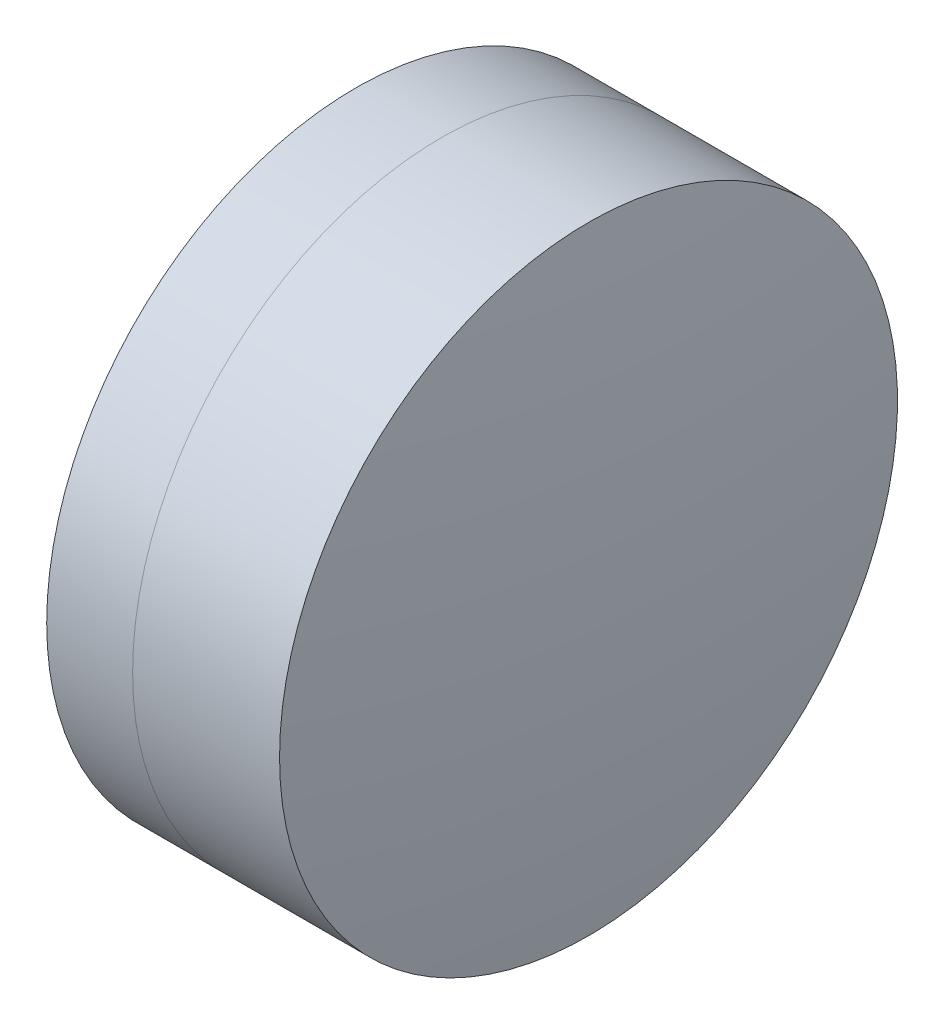
ISO-10303-21;
HEADER;
FILE_DESCRIPTION(('STEP AP214'),'2;1');
FILE_NAME('part.step','',(''),(''),'','','');
FILE_SCHEMA(('AUTOMOTIVE_DESIGN { 1 0 10303 214 1 1 1 1 }'));
ENDSEC;
DATA;
#1=APPLICATION_CONTEXT('core data for automotive mechanical design processes');
#2=APPLICATION_PROTOCOL_DEFINITION('international standard','automotive_design',2000,#1);
#3=PRODUCT_CONTEXT('',#1,'mechanical');
#4=PRODUCT('Part','Part','',(#3));
#5=PRODUCT_RELATED_PRODUCT_CATEGORY('part','',(#4));
#6=PRODUCT_DEFINITION_FORMATION('','',#4);
#7=PRODUCT_DEFINITION_CONTEXT('part definition',#1,'design');
#8=PRODUCT_DEFINITION('design','',#6,#7);
#9=PRODUCT_DEFINITION_SHAPE('','',#8);
#10=(LENGTH_UNIT() NAMED_UNIT(*) SI_UNIT(.MILLI.,.METRE.));
#11=(NAMED_UNIT(*) PLANE_ANGLE_UNIT() SI_UNIT($,.RADIAN.));
#12=(NAMED_UNIT(*) SI_UNIT($,.STERADIAN.) SOLID_ANGLE_UNIT());
#13=UNCERTAINTY_MEASURE_WITH_UNIT(LENGTH_MEASURE(1.E-05),#10,'distance_accuracy_value','');
#14=(GEOMETRIC_REPRESENTATION_CONTEXT(3) GLOBAL_UNCERTAINTY_ASSIGNED_CONTEXT((#13)) GLOBAL_UNIT_ASSIGNED_CONTEXT((#10,
#11,#12)) REPRESENTATION_CONTEXT('',''));
#15=CARTESIAN_POINT('',(0.,0.,0.));
#16=DIRECTION('',(0.,0.,1.));
#17=DIRECTION('',(1.,0.,0.));
#18=AXIS2_PLACEMENT_3D('',#15,#16,#17);
#19=CARTESIAN_POINT('',(208.1421632578,0.,0.));
#20=DIRECTION('',(-1.,0.,0.));
#21=DIRECTION('',(0.,0.,1.));
#22=AXIS2_PLACEMENT_3D('',#19,#20,#21);
#23=SPHERICAL_SURFACE('',#22,19.1);
#24=CARTESIAN_POINT('',(222.408206857902,0.,0.));
#25=DIRECTION('',(-1.,0.,0.));
#26=DIRECTION('',(0.,0.,1.));
#27=AXIS2_PLACEMENT_3D('',#24,#25,#26);
#28=CIRCLE('',#27,12.7);
#29=CARTESIAN_POINT('',(222.408206857902,0.,12.7));
#30=VERTEX_POINT('',#29);
#31=EDGE_CURVE('E11',#30,#30,#28,.T.);
#32=ORIENTED_EDGE('',*,*,#31,.T.);
#33=EDGE_LOOP('',(#32));
#34=FACE_BOUND('',#33,.T.);
#35=ADVANCED_FACE('F45',(#34),#23,.F.);
#36=CARTESIAN_POINT('',(-0.551919992657797,0.,0.));
#37=DIRECTION('',(-1.,0.,0.));
#38=DIRECTION('',(0.,0.,1.));
#39=AXIS2_PLACEMENT_3D('',#36,#37,#38);
#40=CYLINDRICAL_SURFACE('',#39,12.7);
#41=CARTESIAN_POINT('',(228.449221254763,0.,0.));
#42=DIRECTION('',(-1.,0.,0.));
#43=DIRECTION('',(0.,0.,1.));
#44=AXIS2_PLACEMENT_3D('',#41,#42,#43);
#45=CIRCLE('',#44,12.7);
#46=CARTESIAN_POINT('',(228.449221254763,0.,12.7));
#47=VERTEX_POINT('',#46);
#48=EDGE_CURVE('E51',#47,#47,#45,.T.);
#49=ORIENTED_EDGE('',*,*,#48,.T.);
#50=EDGE_LOOP('',(#49));
#51=FACE_BOUND('',#50,.T.);
#52=ORIENTED_EDGE('',*,*,#31,.F.);
#53=EDGE_LOOP('',(#52));
#54=FACE_BOUND('',#53,.T.);
#55=ADVANCED_FACE('F57',(#51,#54),#40,.T.);
#56=CARTESIAN_POINT('',(127.1421632578,0.,0.));
#57=DIRECTION('',(-1.,0.,0.));
#58=DIRECTION('',(0.,0.,1.));
#59=AXIS2_PLACEMENT_3D('',#56,#57,#58);
#60=SPHERICAL_SURFACE('',#59,102.1);
#61=ORIENTED_EDGE('',*,*,#48,.F.);
#62=EDGE_LOOP('',(#61));
#63=FACE_BOUND('',#62,.T.);
#64=ADVANCED_FACE('F60',(#63),#60,.T.);
#65=CLOSED_SHELL('',(#35,#55,#64));
#66=MANIFOLD_SOLID_BREP('B2',#65);
#67=CARTESIAN_POINT('',(239.2421632578,0.,0.));
#68=DIRECTION('',(-1.,0.,0.));
#69=DIRECTION('',(0.,0.,1.));
#70=AXIS2_PLACEMENT_3D('',#67,#68,#69);
#71=SPHERICAL_SURFACE('',#70,24.);
#72=CARTESIAN_POINT('',(218.877733484296,0.,0.));
#73=DIRECTION('',(-1.,0.,0.));
#74=DIRECTION('',(0.,0.,1.));
#75=AXIS2_PLACEMENT_3D('',#72,#73,#74);
#76=CIRCLE('',#75,12.7);
#77=CARTESIAN_POINT('',(218.877733484296,0.,12.7));
#78=VERTEX_POINT('',#77);
#79=EDGE_CURVE('E44',#78,#78,#76,.T.);
#80=ORIENTED_EDGE('',*,*,#79,.T.);
#81=EDGE_LOOP('',(#80));
#82=FACE_BOUND('',#81,.T.);
#83=ADVANCED_FACE('F86',(#82),#71,.T.);
#84=CARTESIAN_POINT('',(-9.70261217833668,0.,0.));
#85=DIRECTION('',(-1.,0.,0.));
#86=DIRECTION('',(0.,0.,1.));
#87=AXIS2_PLACEMENT_3D('',#84,#85,#86);
#88=CYLINDRICAL_SURFACE('',#87,12.7);
#89=CARTESIAN_POINT('',(222.408206857902,0.,0.));
#90=DIRECTION('',(-1.,0.,0.));
#91=DIRECTION('',(0.,0.,1.));
#92=AXIS2_PLACEMENT_3D('',#89,#90,#91);
#93=CIRCLE('',#92,12.7);
#94=CARTESIAN_POINT('',(222.408206857902,0.,12.7));
#95=VERTEX_POINT('',#94);
#96=EDGE_CURVE('E92',#95,#95,#93,.T.);
#97=ORIENTED_EDGE('',*,*,#96,.T.);
#98=EDGE_LOOP('',(#97));
#99=FACE_BOUND('',#98,.T.);
#100=ORIENTED_EDGE('',*,*,#79,.F.);
#101=EDGE_LOOP('',(#100));
#102=FACE_BOUND('',#101,.T.);
#103=ADVANCED_FACE('F98',(#99,#102),#88,.T.);
#104=CARTESIAN_POINT('',(208.1421632578,0.,0.));
#105=DIRECTION('',(-1.,0.,0.));
#106=DIRECTION('',(0.,0.,1.));
#107=AXIS2_PLACEMENT_3D('',#104,#105,#106);
#108=SPHERICAL_SURFACE('',#107,19.1);
#109=ORIENTED_EDGE('',*,*,#96,.F.);
#110=EDGE_LOOP('',(#109));
#111=FACE_BOUND('',#110,.T.);
#112=ADVANCED_FACE('F101',(#111),#108,.T.);
#113=CLOSED_SHELL('',(#83,#103,#112));
#114=MANIFOLD_SOLID_BREP('B6',#113);
#115=ADVANCED_BREP_SHAPE_REPRESENTATION('',(#18,#66,#114),#14);
#116=SHAPE_DEFINITION_REPRESENTATION(#9,#115);
ENDSEC;
END-ISO-10303-21;
